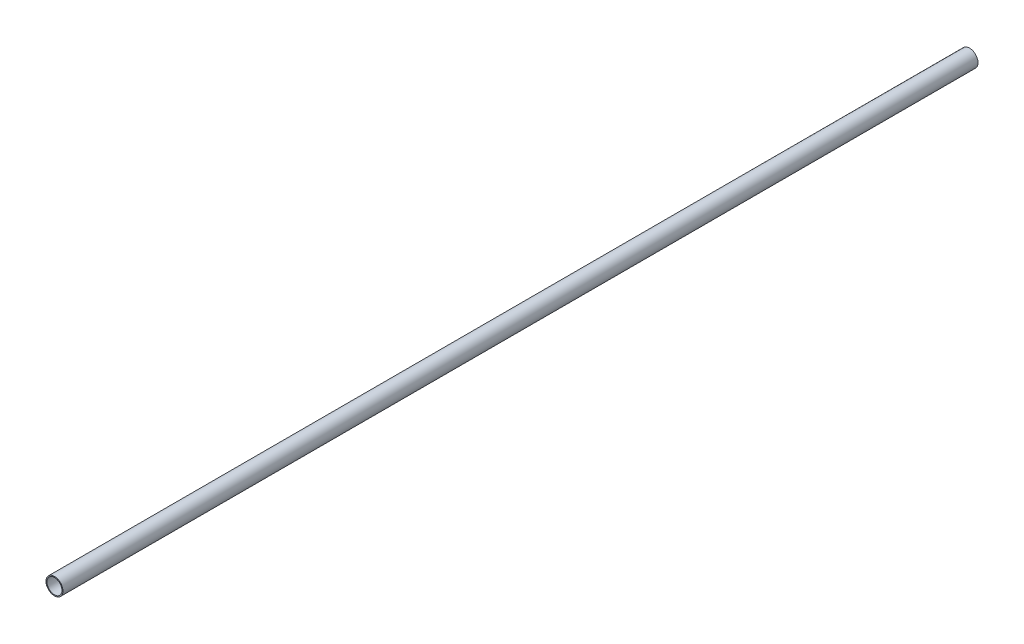
ISO-10303-21;
HEADER;
FILE_DESCRIPTION(('STEP AP214'),'2;1');
FILE_NAME('part.step','',(''),(''),'','','');
FILE_SCHEMA(('AUTOMOTIVE_DESIGN { 1 0 10303 214 1 1 1 1 }'));
ENDSEC;
DATA;
#1=APPLICATION_CONTEXT('core data for automotive mechanical design processes');
#2=APPLICATION_PROTOCOL_DEFINITION('international standard','automotive_design',2000,#1);
#3=PRODUCT_CONTEXT('',#1,'mechanical');
#4=PRODUCT('Part','Part','',(#3));
#5=PRODUCT_RELATED_PRODUCT_CATEGORY('part','',(#4));
#6=PRODUCT_DEFINITION_FORMATION('','',#4);
#7=PRODUCT_DEFINITION_CONTEXT('part definition',#1,'design');
#8=PRODUCT_DEFINITION('design','',#6,#7);
#9=PRODUCT_DEFINITION_SHAPE('','',#8);
#10=(LENGTH_UNIT() NAMED_UNIT(*) SI_UNIT(.MILLI.,.METRE.));
#11=(NAMED_UNIT(*) PLANE_ANGLE_UNIT() SI_UNIT($,.RADIAN.));
#12=(NAMED_UNIT(*) SI_UNIT($,.STERADIAN.) SOLID_ANGLE_UNIT());
#13=UNCERTAINTY_MEASURE_WITH_UNIT(LENGTH_MEASURE(1.E-05),#10,'distance_accuracy_value','');
#14=(GEOMETRIC_REPRESENTATION_CONTEXT(3) GLOBAL_UNCERTAINTY_ASSIGNED_CONTEXT((#13)) GLOBAL_UNIT_ASSIGNED_CONTEXT((#10,
#11,#12)) REPRESENTATION_CONTEXT('',''));
#15=CARTESIAN_POINT('',(0.,0.,0.));
#16=DIRECTION('',(0.,0.,1.));
#17=DIRECTION('',(1.,0.,0.));
#18=AXIS2_PLACEMENT_3D('',#15,#16,#17);
#19=CARTESIAN_POINT('',(0.,0.,5486.4));
#20=DIRECTION('',(0.,0.,1.));
#21=DIRECTION('',(1.,0.,0.));
#22=AXIS2_PLACEMENT_3D('',#19,#20,#21);
#23=PLANE('',#22);
#24=CARTESIAN_POINT('',(0.,0.,5486.4));
#25=DIRECTION('',(0.,0.,1.));
#26=DIRECTION('',(1.,0.,0.));
#27=AXIS2_PLACEMENT_3D('',#24,#25,#26);
#28=CIRCLE('',#27,50.8);
#29=CARTESIAN_POINT('',(50.8,0.,5486.4));
#30=VERTEX_POINT('',#29);
#31=EDGE_CURVE('E10',#30,#30,#28,.T.);
#32=ORIENTED_EDGE('',*,*,#31,.T.);
#33=EDGE_LOOP('',(#32));
#34=FACE_BOUND('',#33,.T.);
#35=CARTESIAN_POINT('',(0.,0.,5486.4));
#36=DIRECTION('',(0.,0.,1.));
#37=DIRECTION('',(1.,0.,0.));
#38=AXIS2_PLACEMENT_3D('',#35,#36,#37);
#39=CIRCLE('',#38,45.0596);
#40=CARTESIAN_POINT('',(45.0596,0.,5486.4));
#41=VERTEX_POINT('',#40);
#42=EDGE_CURVE('E39',#41,#41,#39,.T.);
#43=ORIENTED_EDGE('',*,*,#42,.F.);
#44=EDGE_LOOP('',(#43));
#45=FACE_BOUND('',#44,.T.);
#46=ADVANCED_FACE('F28',(#34,#45),#23,.T.);
#47=CARTESIAN_POINT('',(0.,0.,0.));
#48=DIRECTION('',(0.,0.,1.));
#49=DIRECTION('',(1.,0.,0.));
#50=AXIS2_PLACEMENT_3D('',#47,#48,#49);
#51=PLANE('',#50);
#52=CARTESIAN_POINT('',(0.,0.,0.));
#53=DIRECTION('',(0.,0.,1.));
#54=DIRECTION('',(1.,0.,0.));
#55=AXIS2_PLACEMENT_3D('',#52,#53,#54);
#56=CIRCLE('',#55,50.8);
#57=CARTESIAN_POINT('',(50.8,0.,0.));
#58=VERTEX_POINT('',#57);
#59=EDGE_CURVE('E32',#58,#58,#56,.T.);
#60=ORIENTED_EDGE('',*,*,#59,.F.);
#61=EDGE_LOOP('',(#60));
#62=FACE_BOUND('',#61,.T.);
#63=CARTESIAN_POINT('',(0.,0.,0.));
#64=DIRECTION('',(0.,0.,1.));
#65=DIRECTION('',(1.,0.,0.));
#66=AXIS2_PLACEMENT_3D('',#63,#64,#65);
#67=CIRCLE('',#66,45.0596);
#68=CARTESIAN_POINT('',(45.0596,0.,0.));
#69=VERTEX_POINT('',#68);
#70=EDGE_CURVE('E41',#69,#69,#67,.T.);
#71=ORIENTED_EDGE('',*,*,#70,.T.);
#72=EDGE_LOOP('',(#71));
#73=FACE_BOUND('',#72,.T.);
#74=ADVANCED_FACE('F51',(#62,#73),#51,.F.);
#75=CARTESIAN_POINT('',(0.,0.,5486.4));
#76=DIRECTION('',(0.,0.,-1.));
#77=DIRECTION('',(-1.,0.,0.));
#78=AXIS2_PLACEMENT_3D('',#75,#76,#77);
#79=CYLINDRICAL_SURFACE('',#78,50.8);
#80=ORIENTED_EDGE('',*,*,#31,.F.);
#81=EDGE_LOOP('',(#80));
#82=FACE_BOUND('',#81,.T.);
#83=ORIENTED_EDGE('',*,*,#59,.T.);
#84=EDGE_LOOP('',(#83));
#85=FACE_BOUND('',#84,.T.);
#86=ADVANCED_FACE('F30',(#82,#85),#79,.T.);
#87=CARTESIAN_POINT('',(0.,0.,5486.4));
#88=DIRECTION('',(0.,0.,-1.));
#89=DIRECTION('',(-1.,0.,0.));
#90=AXIS2_PLACEMENT_3D('',#87,#88,#89);
#91=CYLINDRICAL_SURFACE('',#90,45.0596);
#92=ORIENTED_EDGE('',*,*,#42,.T.);
#93=EDGE_LOOP('',(#92));
#94=FACE_BOUND('',#93,.T.);
#95=ORIENTED_EDGE('',*,*,#70,.F.);
#96=EDGE_LOOP('',(#95));
#97=FACE_BOUND('',#96,.T.);
#98=ADVANCED_FACE('F47',(#94,#97),#91,.F.);
#99=CLOSED_SHELL('',(#46,#74,#86,#98));
#100=MANIFOLD_SOLID_BREP('B2',#99);
#101=ADVANCED_BREP_SHAPE_REPRESENTATION('',(#18,#100),#14);
#102=SHAPE_DEFINITION_REPRESENTATION(#9,#101);
ENDSEC;
END-ISO-10303-21;
